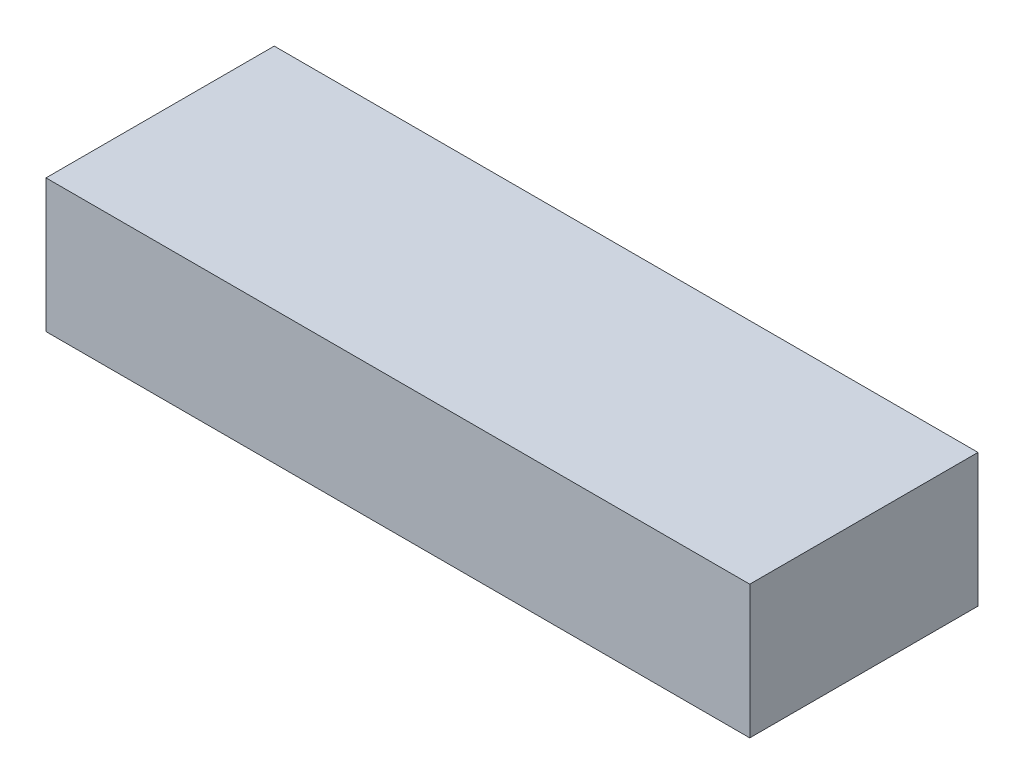
ISO-10303-21;
HEADER;
FILE_DESCRIPTION(('STEP AP214'),'2;1');
FILE_NAME('part.step','',(''),(''),'','','');
FILE_SCHEMA(('AUTOMOTIVE_DESIGN { 1 0 10303 214 1 1 1 1 }'));
ENDSEC;
DATA;
#1=APPLICATION_CONTEXT('core data for automotive mechanical design processes');
#2=APPLICATION_PROTOCOL_DEFINITION('international standard','automotive_design',2000,#1);
#3=PRODUCT_CONTEXT('',#1,'mechanical');
#4=PRODUCT('Part','Part','',(#3));
#5=PRODUCT_RELATED_PRODUCT_CATEGORY('part','',(#4));
#6=PRODUCT_DEFINITION_FORMATION('','',#4);
#7=PRODUCT_DEFINITION_CONTEXT('part definition',#1,'design');
#8=PRODUCT_DEFINITION('design','',#6,#7);
#9=PRODUCT_DEFINITION_SHAPE('','',#8);
#10=(LENGTH_UNIT() NAMED_UNIT(*) SI_UNIT(.MILLI.,.METRE.));
#11=(NAMED_UNIT(*) PLANE_ANGLE_UNIT() SI_UNIT($,.RADIAN.));
#12=(NAMED_UNIT(*) SI_UNIT($,.STERADIAN.) SOLID_ANGLE_UNIT());
#13=UNCERTAINTY_MEASURE_WITH_UNIT(LENGTH_MEASURE(1.E-05),#10,'distance_accuracy_value','');
#14=(GEOMETRIC_REPRESENTATION_CONTEXT(3) GLOBAL_UNCERTAINTY_ASSIGNED_CONTEXT((#13)) GLOBAL_UNIT_ASSIGNED_CONTEXT((#10,
#11,#12)) REPRESENTATION_CONTEXT('',''));
#15=CARTESIAN_POINT('',(0.,0.,0.));
#16=DIRECTION('',(0.,0.,1.));
#17=DIRECTION('',(1.,0.,0.));
#18=AXIS2_PLACEMENT_3D('',#15,#16,#17);
#19=CARTESIAN_POINT('',(-37.,14.,-12.));
#20=DIRECTION('',(1.,0.,0.));
#21=DIRECTION('',(0.,0.,-1.));
#22=AXIS2_PLACEMENT_3D('',#19,#20,#21);
#23=PLANE('',#22);
#24=DIRECTION('',(0.,0.,1.));
#25=VECTOR('',#24,1.);
#26=CARTESIAN_POINT('',(-37.,0.,-12.));
#27=LINE('',#26,#25);
#28=CARTESIAN_POINT('',(-37.,0.,-12.));
#29=VERTEX_POINT('',#28);
#30=CARTESIAN_POINT('',(-37.,0.,12.));
#31=VERTEX_POINT('',#30);
#32=EDGE_CURVE('E96',#29,#31,#27,.T.);
#33=ORIENTED_EDGE('',*,*,#32,.T.);
#34=DIRECTION('',(0.,-1.,0.));
#35=VECTOR('',#34,1.);
#36=CARTESIAN_POINT('',(-37.,14.,12.));
#37=LINE('',#36,#35);
#38=CARTESIAN_POINT('',(-37.,14.,12.));
#39=VERTEX_POINT('',#38);
#40=EDGE_CURVE('E11',#39,#31,#37,.T.);
#41=ORIENTED_EDGE('',*,*,#40,.F.);
#42=DIRECTION('',(0.,0.,1.));
#43=VECTOR('',#42,1.);
#44=CARTESIAN_POINT('',(-37.,14.,-12.));
#45=LINE('',#44,#43);
#46=CARTESIAN_POINT('',(-37.,14.,-12.));
#47=VERTEX_POINT('',#46);
#48=EDGE_CURVE('E84',#47,#39,#45,.T.);
#49=ORIENTED_EDGE('',*,*,#48,.F.);
#50=DIRECTION('',(0.,-1.,0.));
#51=VECTOR('',#50,1.);
#52=CARTESIAN_POINT('',(-37.,14.,-12.));
#53=LINE('',#52,#51);
#54=EDGE_CURVE('E92',#47,#29,#53,.T.);
#55=ORIENTED_EDGE('',*,*,#54,.T.);
#56=EDGE_LOOP('',(#33,#41,#49,#55));
#57=FACE_BOUND('',#56,.T.);
#58=ADVANCED_FACE('F33',(#57),#23,.F.);
#59=CARTESIAN_POINT('',(37.,14.,12.));
#60=DIRECTION('',(0.,0.,-1.));
#61=DIRECTION('',(-1.,0.,0.));
#62=AXIS2_PLACEMENT_3D('',#59,#60,#61);
#63=PLANE('',#62);
#64=DIRECTION('',(1.,0.,0.));
#65=VECTOR('',#64,1.);
#66=CARTESIAN_POINT('',(37.,0.,12.));
#67=LINE('',#66,#65);
#68=CARTESIAN_POINT('',(37.,0.,12.));
#69=VERTEX_POINT('',#68);
#70=EDGE_CURVE('E88',#31,#69,#67,.T.);
#71=ORIENTED_EDGE('',*,*,#70,.T.);
#72=DIRECTION('',(0.,-1.,0.));
#73=VECTOR('',#72,1.);
#74=CARTESIAN_POINT('',(37.,14.,12.));
#75=LINE('',#74,#73);
#76=CARTESIAN_POINT('',(37.,14.,12.));
#77=VERTEX_POINT('',#76);
#78=EDGE_CURVE('E41',#77,#69,#75,.T.);
#79=ORIENTED_EDGE('',*,*,#78,.F.);
#80=DIRECTION('',(1.,0.,0.));
#81=VECTOR('',#80,1.);
#82=CARTESIAN_POINT('',(37.,14.,12.));
#83=LINE('',#82,#81);
#84=EDGE_CURVE('E79',#39,#77,#83,.T.);
#85=ORIENTED_EDGE('',*,*,#84,.F.);
#86=ORIENTED_EDGE('',*,*,#40,.T.);
#87=EDGE_LOOP('',(#71,#79,#85,#86));
#88=FACE_BOUND('',#87,.T.);
#89=ADVANCED_FACE('F87',(#88),#63,.F.);
#90=CARTESIAN_POINT('',(37.,14.,-12.));
#91=DIRECTION('',(-1.,0.,0.));
#92=DIRECTION('',(0.,0.,1.));
#93=AXIS2_PLACEMENT_3D('',#90,#91,#92);
#94=PLANE('',#93);
#95=DIRECTION('',(0.,0.,-1.));
#96=VECTOR('',#95,1.);
#97=CARTESIAN_POINT('',(37.,0.,-12.));
#98=LINE('',#97,#96);
#99=CARTESIAN_POINT('',(37.,0.,-12.));
#100=VERTEX_POINT('',#99);
#101=EDGE_CURVE('E66',#69,#100,#98,.T.);
#102=ORIENTED_EDGE('',*,*,#101,.T.);
#103=DIRECTION('',(0.,-1.,0.));
#104=VECTOR('',#103,1.);
#105=CARTESIAN_POINT('',(37.,14.,-12.));
#106=LINE('',#105,#104);
#107=CARTESIAN_POINT('',(37.,14.,-12.));
#108=VERTEX_POINT('',#107);
#109=EDGE_CURVE('E89',#108,#100,#106,.T.);
#110=ORIENTED_EDGE('',*,*,#109,.F.);
#111=DIRECTION('',(0.,0.,-1.));
#112=VECTOR('',#111,1.);
#113=CARTESIAN_POINT('',(37.,14.,-12.));
#114=LINE('',#113,#112);
#115=EDGE_CURVE('E82',#77,#108,#114,.T.);
#116=ORIENTED_EDGE('',*,*,#115,.F.);
#117=ORIENTED_EDGE('',*,*,#78,.T.);
#118=EDGE_LOOP('',(#102,#110,#116,#117));
#119=FACE_BOUND('',#118,.T.);
#120=ADVANCED_FACE('F90',(#119),#94,.F.);
#121=CARTESIAN_POINT('',(37.,14.,-12.));
#122=DIRECTION('',(0.,0.,1.));
#123=DIRECTION('',(1.,0.,0.));
#124=AXIS2_PLACEMENT_3D('',#121,#122,#123);
#125=PLANE('',#124);
#126=DIRECTION('',(-1.,0.,0.));
#127=VECTOR('',#126,1.);
#128=CARTESIAN_POINT('',(37.,0.,-12.));
#129=LINE('',#128,#127);
#130=EDGE_CURVE('E72',#100,#29,#129,.T.);
#131=ORIENTED_EDGE('',*,*,#130,.T.);
#132=ORIENTED_EDGE('',*,*,#54,.F.);
#133=DIRECTION('',(-1.,0.,0.));
#134=VECTOR('',#133,1.);
#135=CARTESIAN_POINT('',(37.,14.,-12.));
#136=LINE('',#135,#134);
#137=EDGE_CURVE('E49',#108,#47,#136,.T.);
#138=ORIENTED_EDGE('',*,*,#137,.F.);
#139=ORIENTED_EDGE('',*,*,#109,.T.);
#140=EDGE_LOOP('',(#131,#132,#138,#139));
#141=FACE_BOUND('',#140,.T.);
#142=ADVANCED_FACE('F103',(#141),#125,.F.);
#143=CARTESIAN_POINT('',(0.,14.,0.));
#144=DIRECTION('',(0.,-1.,0.));
#145=DIRECTION('',(0.,0.,-1.));
#146=AXIS2_PLACEMENT_3D('',#143,#144,#145);
#147=PLANE('',#146);
#148=ORIENTED_EDGE('',*,*,#48,.T.);
#149=ORIENTED_EDGE('',*,*,#84,.T.);
#150=ORIENTED_EDGE('',*,*,#115,.T.);
#151=ORIENTED_EDGE('',*,*,#137,.T.);
#152=EDGE_LOOP('',(#148,#149,#150,#151));
#153=FACE_BOUND('',#152,.T.);
#154=ADVANCED_FACE('F80',(#153),#147,.F.);
#155=CARTESIAN_POINT('',(0.,0.,0.));
#156=DIRECTION('',(0.,-1.,0.));
#157=DIRECTION('',(0.,0.,-1.));
#158=AXIS2_PLACEMENT_3D('',#155,#156,#157);
#159=PLANE('',#158);
#160=ORIENTED_EDGE('',*,*,#32,.F.);
#161=ORIENTED_EDGE('',*,*,#130,.F.);
#162=ORIENTED_EDGE('',*,*,#101,.F.);
#163=ORIENTED_EDGE('',*,*,#70,.F.);
#164=EDGE_LOOP('',(#160,#161,#162,#163));
#165=FACE_BOUND('',#164,.T.);
#166=ADVANCED_FACE('F106',(#165),#159,.T.);
#167=CLOSED_SHELL('',(#58,#89,#120,#142,#154,#166));
#168=MANIFOLD_SOLID_BREP('B2',#167);
#169=ADVANCED_BREP_SHAPE_REPRESENTATION('',(#18,#168),#14);
#170=SHAPE_DEFINITION_REPRESENTATION(#9,#169);
ENDSEC;
END-ISO-10303-21;
